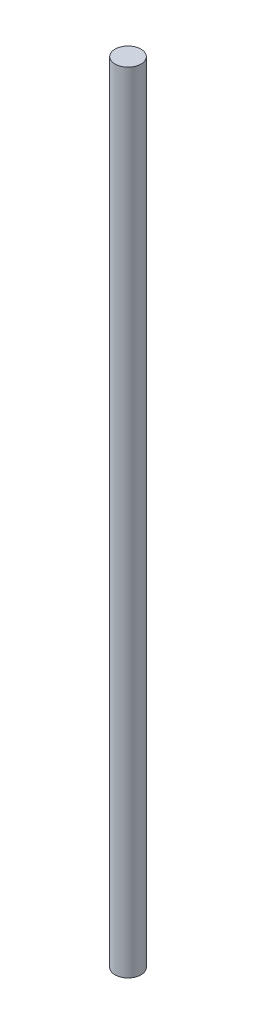
ISO-10303-21;
HEADER;
FILE_DESCRIPTION(('STEP AP214'),'2;1');
FILE_NAME('part.step','',(''),(''),'','','');
FILE_SCHEMA(('AUTOMOTIVE_DESIGN { 1 0 10303 214 1 1 1 1 }'));
ENDSEC;
DATA;
#1=APPLICATION_CONTEXT('core data for automotive mechanical design processes');
#2=APPLICATION_PROTOCOL_DEFINITION('international standard','automotive_design',2000,#1);
#3=PRODUCT_CONTEXT('',#1,'mechanical');
#4=PRODUCT('Part','Part','',(#3));
#5=PRODUCT_RELATED_PRODUCT_CATEGORY('part','',(#4));
#6=PRODUCT_DEFINITION_FORMATION('','',#4);
#7=PRODUCT_DEFINITION_CONTEXT('part definition',#1,'design');
#8=PRODUCT_DEFINITION('design','',#6,#7);
#9=PRODUCT_DEFINITION_SHAPE('','',#8);
#10=(LENGTH_UNIT() NAMED_UNIT(*) SI_UNIT(.MILLI.,.METRE.));
#11=(NAMED_UNIT(*) PLANE_ANGLE_UNIT() SI_UNIT($,.RADIAN.));
#12=(NAMED_UNIT(*) SI_UNIT($,.STERADIAN.) SOLID_ANGLE_UNIT());
#13=UNCERTAINTY_MEASURE_WITH_UNIT(LENGTH_MEASURE(1.E-05),#10,'distance_accuracy_value','');
#14=(GEOMETRIC_REPRESENTATION_CONTEXT(3) GLOBAL_UNCERTAINTY_ASSIGNED_CONTEXT((#13)) GLOBAL_UNIT_ASSIGNED_CONTEXT((#10,
#11,#12)) REPRESENTATION_CONTEXT('',''));
#15=CARTESIAN_POINT('',(0.,0.,0.));
#16=DIRECTION('',(0.,0.,1.));
#17=DIRECTION('',(1.,0.,0.));
#18=AXIS2_PLACEMENT_3D('',#15,#16,#17);
#19=CARTESIAN_POINT('',(0.,91.1875,0.));
#20=DIRECTION('',(0.,-1.,0.));
#21=DIRECTION('',(0.,0.,-1.));
#22=AXIS2_PLACEMENT_3D('',#19,#20,#21);
#23=PLANE('',#22);
#24=CARTESIAN_POINT('',(0.,91.1875,0.));
#25=DIRECTION('',(0.,-1.,0.));
#26=DIRECTION('',(0.,0.,-1.));
#27=AXIS2_PLACEMENT_3D('',#24,#25,#26);
#28=CIRCLE('',#27,3.);
#29=CARTESIAN_POINT('',(0.,91.1875,-3.));
#30=VERTEX_POINT('',#29);
#31=EDGE_CURVE('E11',#30,#30,#28,.T.);
#32=ORIENTED_EDGE('',*,*,#31,.F.);
#33=EDGE_LOOP('',(#32));
#34=FACE_BOUND('',#33,.T.);
#35=ADVANCED_FACE('F16',(#34),#23,.F.);
#36=CARTESIAN_POINT('',(0.,-91.1875,0.));
#37=DIRECTION('',(0.,-1.,0.));
#38=DIRECTION('',(0.,0.,-1.));
#39=AXIS2_PLACEMENT_3D('',#36,#37,#38);
#40=PLANE('',#39);
#41=CARTESIAN_POINT('',(0.,-91.1875,0.));
#42=DIRECTION('',(0.,-1.,0.));
#43=DIRECTION('',(0.,0.,-1.));
#44=AXIS2_PLACEMENT_3D('',#41,#42,#43);
#45=CIRCLE('',#44,3.);
#46=CARTESIAN_POINT('',(0.,-91.1875,-3.));
#47=VERTEX_POINT('',#46);
#48=EDGE_CURVE('E26',#47,#47,#45,.T.);
#49=ORIENTED_EDGE('',*,*,#48,.T.);
#50=EDGE_LOOP('',(#49));
#51=FACE_BOUND('',#50,.T.);
#52=ADVANCED_FACE('F39',(#51),#40,.T.);
#53=CARTESIAN_POINT('',(0.,-91.1875,0.));
#54=DIRECTION('',(0.,1.,0.));
#55=DIRECTION('',(0.,0.,1.));
#56=AXIS2_PLACEMENT_3D('',#53,#54,#55);
#57=CYLINDRICAL_SURFACE('',#56,3.);
#58=ORIENTED_EDGE('',*,*,#31,.T.);
#59=EDGE_LOOP('',(#58));
#60=FACE_BOUND('',#59,.T.);
#61=ORIENTED_EDGE('',*,*,#48,.F.);
#62=EDGE_LOOP('',(#61));
#63=FACE_BOUND('',#62,.T.);
#64=ADVANCED_FACE('F18',(#60,#63),#57,.T.);
#65=CLOSED_SHELL('',(#35,#52,#64));
#66=MANIFOLD_SOLID_BREP('B1',#65);
#67=ADVANCED_BREP_SHAPE_REPRESENTATION('',(#18,#66),#14);
#68=SHAPE_DEFINITION_REPRESENTATION(#9,#67);
ENDSEC;
END-ISO-10303-21;
